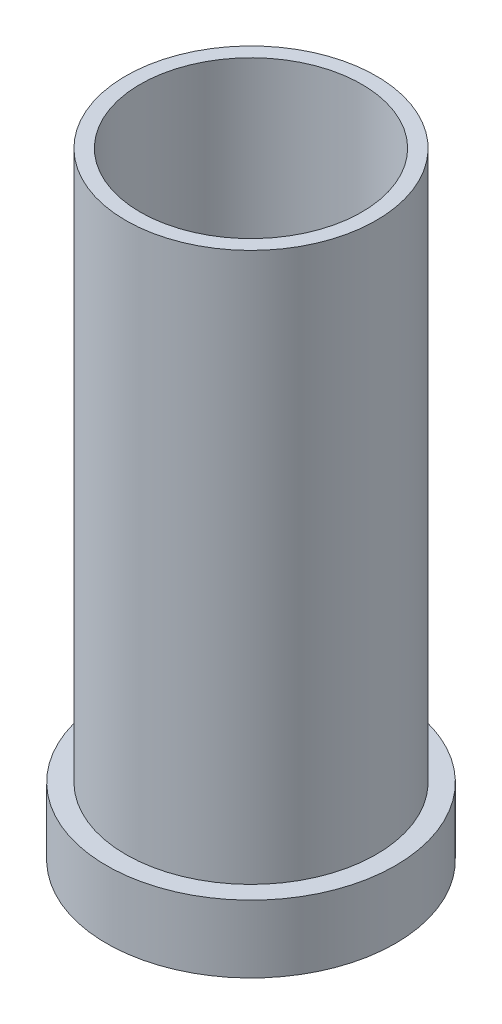
ISO-10303-21;
HEADER;
FILE_DESCRIPTION(('STEP AP214'),'2;1');
FILE_NAME('part.step','',(''),(''),'','','');
FILE_SCHEMA(('AUTOMOTIVE_DESIGN { 1 0 10303 214 1 1 1 1 }'));
ENDSEC;
DATA;
#1=APPLICATION_CONTEXT('core data for automotive mechanical design processes');
#2=APPLICATION_PROTOCOL_DEFINITION('international standard','automotive_design',2000,#1);
#3=PRODUCT_CONTEXT('',#1,'mechanical');
#4=PRODUCT('Part','Part','',(#3));
#5=PRODUCT_RELATED_PRODUCT_CATEGORY('part','',(#4));
#6=PRODUCT_DEFINITION_FORMATION('','',#4);
#7=PRODUCT_DEFINITION_CONTEXT('part definition',#1,'design');
#8=PRODUCT_DEFINITION('design','',#6,#7);
#9=PRODUCT_DEFINITION_SHAPE('','',#8);
#10=(LENGTH_UNIT() NAMED_UNIT(*) SI_UNIT(.MILLI.,.METRE.));
#11=(NAMED_UNIT(*) PLANE_ANGLE_UNIT() SI_UNIT($,.RADIAN.));
#12=(NAMED_UNIT(*) SI_UNIT($,.STERADIAN.) SOLID_ANGLE_UNIT());
#13=UNCERTAINTY_MEASURE_WITH_UNIT(LENGTH_MEASURE(1.E-05),#10,'distance_accuracy_value','');
#14=(GEOMETRIC_REPRESENTATION_CONTEXT(3) GLOBAL_UNCERTAINTY_ASSIGNED_CONTEXT((#13)) GLOBAL_UNIT_ASSIGNED_CONTEXT((#10,
#11,#12)) REPRESENTATION_CONTEXT('',''));
#15=CARTESIAN_POINT('',(0.,0.,0.));
#16=DIRECTION('',(0.,0.,1.));
#17=DIRECTION('',(1.,0.,0.));
#18=AXIS2_PLACEMENT_3D('',#15,#16,#17);
#19=CARTESIAN_POINT('',(0.,-3.5,0.));
#20=DIRECTION('',(0.,1.,0.));
#21=DIRECTION('',(0.,0.,1.));
#22=AXIS2_PLACEMENT_3D('',#19,#20,#21);
#23=CYLINDRICAL_SURFACE('',#22,7.5);
#24=CARTESIAN_POINT('',(0.,-3.5,0.));
#25=DIRECTION('',(0.,1.,0.));
#26=DIRECTION('',(1.,0.,0.));
#27=AXIS2_PLACEMENT_3D('',#24,#25,#26);
#28=CIRCLE('',#27,7.5);
#29=CARTESIAN_POINT('',(7.5,-3.5,0.));
#30=VERTEX_POINT('',#29);
#31=EDGE_CURVE('E12',#30,#30,#28,.T.);
#32=ORIENTED_EDGE('',*,*,#31,.T.);
#33=EDGE_LOOP('',(#32));
#34=FACE_BOUND('',#33,.T.);
#35=CARTESIAN_POINT('',(0.,0.,0.));
#36=DIRECTION('',(0.,1.,0.));
#37=DIRECTION('',(1.,0.,0.));
#38=AXIS2_PLACEMENT_3D('',#35,#36,#37);
#39=CIRCLE('',#38,7.5);
#40=CARTESIAN_POINT('',(7.5,0.,0.));
#41=VERTEX_POINT('',#40);
#42=EDGE_CURVE('E46',#41,#41,#39,.T.);
#43=ORIENTED_EDGE('',*,*,#42,.F.);
#44=EDGE_LOOP('',(#43));
#45=FACE_BOUND('',#44,.T.);
#46=ADVANCED_FACE('F43',(#34,#45),#23,.T.);
#47=CARTESIAN_POINT('',(0.,-3.5,0.));
#48=DIRECTION('',(0.,1.,0.));
#49=DIRECTION('',(0.,0.,1.));
#50=AXIS2_PLACEMENT_3D('',#47,#48,#49);
#51=PLANE('',#50);
#52=CARTESIAN_POINT('',(0.,-3.5,0.));
#53=DIRECTION('',(0.,1.,0.));
#54=DIRECTION('',(0.,0.,1.));
#55=AXIS2_PLACEMENT_3D('',#52,#53,#54);
#56=CIRCLE('',#55,5.5);
#57=CARTESIAN_POINT('',(0.,-3.5,5.5));
#58=VERTEX_POINT('',#57);
#59=EDGE_CURVE('E77',#58,#58,#56,.T.);
#60=ORIENTED_EDGE('',*,*,#59,.T.);
#61=EDGE_LOOP('',(#60));
#62=FACE_BOUND('',#61,.T.);
#63=ORIENTED_EDGE('',*,*,#31,.F.);
#64=EDGE_LOOP('',(#63));
#65=FACE_BOUND('',#64,.T.);
#66=ADVANCED_FACE('F89',(#62,#65),#51,.F.);
#67=CARTESIAN_POINT('',(0.,0.,0.));
#68=DIRECTION('',(0.,1.,0.));
#69=DIRECTION('',(0.,0.,1.));
#70=AXIS2_PLACEMENT_3D('',#67,#68,#69);
#71=PLANE('',#70);
#72=CARTESIAN_POINT('',(0.,0.,0.));
#73=DIRECTION('',(0.,1.,0.));
#74=DIRECTION('',(0.,0.,1.));
#75=AXIS2_PLACEMENT_3D('',#72,#73,#74);
#76=CIRCLE('',#75,6.5);
#77=CARTESIAN_POINT('',(0.,0.,6.5));
#78=VERTEX_POINT('',#77);
#79=EDGE_CURVE('E73',#78,#78,#76,.T.);
#80=ORIENTED_EDGE('',*,*,#79,.F.);
#81=EDGE_LOOP('',(#80));
#82=FACE_BOUND('',#81,.T.);
#83=ORIENTED_EDGE('',*,*,#42,.T.);
#84=EDGE_LOOP('',(#83));
#85=FACE_BOUND('',#84,.T.);
#86=ADVANCED_FACE('F86',(#82,#85),#71,.T.);
#87=CARTESIAN_POINT('',(0.,-3.5,0.));
#88=DIRECTION('',(0.,1.,0.));
#89=DIRECTION('',(0.,0.,1.));
#90=AXIS2_PLACEMENT_3D('',#87,#88,#89);
#91=CYLINDRICAL_SURFACE('',#90,5.5);
#92=ORIENTED_EDGE('',*,*,#59,.F.);
#93=EDGE_LOOP('',(#92));
#94=FACE_BOUND('',#93,.T.);
#95=CARTESIAN_POINT('',(0.,0.5,0.));
#96=DIRECTION('',(0.,-1.,0.));
#97=DIRECTION('',(0.,0.,-1.));
#98=AXIS2_PLACEMENT_3D('',#95,#96,#97);
#99=CIRCLE('',#98,5.5);
#100=CARTESIAN_POINT('',(0.,0.5,-5.5));
#101=VERTEX_POINT('',#100);
#102=EDGE_CURVE('E63',#101,#101,#99,.T.);
#103=ORIENTED_EDGE('',*,*,#102,.F.);
#104=EDGE_LOOP('',(#103));
#105=FACE_BOUND('',#104,.T.);
#106=ADVANCED_FACE('F100',(#94,#105),#91,.F.);
#107=CARTESIAN_POINT('',(0.,28.5,0.));
#108=DIRECTION('',(0.,-1.,0.));
#109=DIRECTION('',(0.,0.,-1.));
#110=AXIS2_PLACEMENT_3D('',#107,#108,#109);
#111=CYLINDRICAL_SURFACE('',#110,6.5);
#112=CARTESIAN_POINT('',(0.,28.5,0.));
#113=DIRECTION('',(0.,1.,0.));
#114=DIRECTION('',(0.,0.,1.));
#115=AXIS2_PLACEMENT_3D('',#112,#113,#114);
#116=CIRCLE('',#115,6.5);
#117=CARTESIAN_POINT('',(0.,28.5,6.5));
#118=VERTEX_POINT('',#117);
#119=EDGE_CURVE('E74',#118,#118,#116,.T.);
#120=ORIENTED_EDGE('',*,*,#119,.F.);
#121=EDGE_LOOP('',(#120));
#122=FACE_BOUND('',#121,.T.);
#123=ORIENTED_EDGE('',*,*,#79,.T.);
#124=EDGE_LOOP('',(#123));
#125=FACE_BOUND('',#124,.T.);
#126=ADVANCED_FACE('F105',(#122,#125),#111,.T.);
#127=CARTESIAN_POINT('',(0.,28.5,0.));
#128=DIRECTION('',(0.,1.,0.));
#129=DIRECTION('',(0.,0.,1.));
#130=AXIS2_PLACEMENT_3D('',#127,#128,#129);
#131=PLANE('',#130);
#132=CARTESIAN_POINT('',(0.,28.5,0.));
#133=DIRECTION('',(0.,1.,0.));
#134=DIRECTION('',(0.,0.,1.));
#135=AXIS2_PLACEMENT_3D('',#132,#133,#134);
#136=CIRCLE('',#135,5.75);
#137=CARTESIAN_POINT('',(0.,28.5,5.75));
#138=VERTEX_POINT('',#137);
#139=EDGE_CURVE('E65',#138,#138,#136,.T.);
#140=ORIENTED_EDGE('',*,*,#139,.F.);
#141=EDGE_LOOP('',(#140));
#142=FACE_BOUND('',#141,.T.);
#143=ORIENTED_EDGE('',*,*,#119,.T.);
#144=EDGE_LOOP('',(#143));
#145=FACE_BOUND('',#144,.T.);
#146=ADVANCED_FACE('F109',(#142,#145),#131,.T.);
#147=CARTESIAN_POINT('',(0.,10.,0.));
#148=DIRECTION('',(0.,1.,0.));
#149=DIRECTION('',(0.,0.,1.));
#150=AXIS2_PLACEMENT_3D('',#147,#148,#149);
#151=CONICAL_SURFACE('',#150,5.75,1.01229096615671);
#152=CARTESIAN_POINT('',(0.,6.40700122652137,0.));
#153=VERTEX_POINT('',#152);
#154=VERTEX_LOOP('',#153);
#155=FACE_BOUND('',#154,.T.);
#156=CARTESIAN_POINT('',(0.,10.,0.));
#157=DIRECTION('',(0.,1.,0.));
#158=DIRECTION('',(0.,0.,1.));
#159=AXIS2_PLACEMENT_3D('',#156,#157,#158);
#160=CIRCLE('',#159,5.75);
#161=CARTESIAN_POINT('',(0.,10.,5.75));
#162=VERTEX_POINT('',#161);
#163=EDGE_CURVE('E68',#162,#162,#160,.T.);
#164=ORIENTED_EDGE('',*,*,#163,.T.);
#165=EDGE_LOOP('',(#164));
#166=FACE_BOUND('',#165,.T.);
#167=ADVANCED_FACE('F113',(#155,#166),#151,.F.);
#168=CARTESIAN_POINT('',(0.,28.5,0.));
#169=DIRECTION('',(0.,1.,0.));
#170=DIRECTION('',(0.,0.,1.));
#171=AXIS2_PLACEMENT_3D('',#168,#169,#170);
#172=CYLINDRICAL_SURFACE('',#171,5.75);
#173=ORIENTED_EDGE('',*,*,#163,.F.);
#174=EDGE_LOOP('',(#173));
#175=FACE_BOUND('',#174,.T.);
#176=ORIENTED_EDGE('',*,*,#139,.T.);
#177=EDGE_LOOP('',(#176));
#178=FACE_BOUND('',#177,.T.);
#179=ADVANCED_FACE('F59',(#175,#178),#172,.F.);
#180=CARTESIAN_POINT('',(0.,0.5,0.));
#181=DIRECTION('',(0.,-1.,0.));
#182=DIRECTION('',(0.,0.,-1.));
#183=AXIS2_PLACEMENT_3D('',#180,#181,#182);
#184=CONICAL_SURFACE('',#183,5.5,1.01229096615671);
#185=CARTESIAN_POINT('',(0.,3.9367814355013,0.));
#186=VERTEX_POINT('',#185);
#187=VERTEX_LOOP('',#186);
#188=FACE_BOUND('',#187,.T.);
#189=ORIENTED_EDGE('',*,*,#102,.T.);
#190=EDGE_LOOP('',(#189));
#191=FACE_BOUND('',#190,.T.);
#192=ADVANCED_FACE('F56',(#188,#191),#184,.F.);
#193=CLOSED_SHELL('',(#46,#66,#86,#106,#126,#146,#167,#179,#192));
#194=MANIFOLD_SOLID_BREP('B2',#193);
#195=ADVANCED_BREP_SHAPE_REPRESENTATION('',(#18,#194),#14);
#196=SHAPE_DEFINITION_REPRESENTATION(#9,#195);
ENDSEC;
END-ISO-10303-21;
